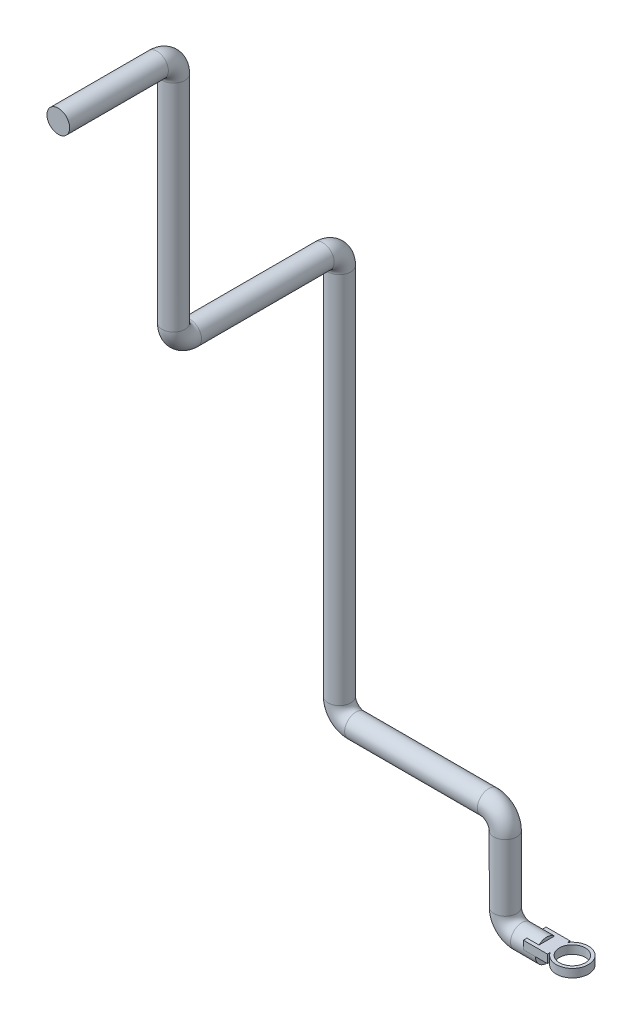
ISO-10303-21;
HEADER;
FILE_DESCRIPTION(('STEP AP214'),'2;1');
FILE_NAME('part.step','',(''),(''),'','','');
FILE_SCHEMA(('AUTOMOTIVE_DESIGN { 1 0 10303 214 1 1 1 1 }'));
ENDSEC;
DATA;
#1=APPLICATION_CONTEXT('core data for automotive mechanical design processes');
#2=APPLICATION_PROTOCOL_DEFINITION('international standard','automotive_design',2000,#1);
#3=PRODUCT_CONTEXT('',#1,'mechanical');
#4=PRODUCT('Part','Part','',(#3));
#5=PRODUCT_RELATED_PRODUCT_CATEGORY('part','',(#4));
#6=PRODUCT_DEFINITION_FORMATION('','',#4);
#7=PRODUCT_DEFINITION_CONTEXT('part definition',#1,'design');
#8=PRODUCT_DEFINITION('design','',#6,#7);
#9=PRODUCT_DEFINITION_SHAPE('','',#8);
#10=(LENGTH_UNIT() NAMED_UNIT(*) SI_UNIT(.MILLI.,.METRE.));
#11=(NAMED_UNIT(*) PLANE_ANGLE_UNIT() SI_UNIT($,.RADIAN.));
#12=(NAMED_UNIT(*) SI_UNIT($,.STERADIAN.) SOLID_ANGLE_UNIT());
#13=UNCERTAINTY_MEASURE_WITH_UNIT(LENGTH_MEASURE(1.E-05),#10,'distance_accuracy_value','');
#14=(GEOMETRIC_REPRESENTATION_CONTEXT(3) GLOBAL_UNCERTAINTY_ASSIGNED_CONTEXT((#13)) GLOBAL_UNIT_ASSIGNED_CONTEXT((#10,
#11,#12)) REPRESENTATION_CONTEXT('',''));
#15=CARTESIAN_POINT('',(0.,0.,0.));
#16=DIRECTION('',(0.,0.,1.));
#17=DIRECTION('',(1.,0.,0.));
#18=AXIS2_PLACEMENT_3D('',#15,#16,#17);
#19=CARTESIAN_POINT('',(14.5121336109629,10.,-13.7027745425676));
#20=DIRECTION('',(-1.,0.,0.));
#21=DIRECTION('',(0.,0.,1.));
#22=AXIS2_PLACEMENT_3D('',#19,#20,#21);
#23=PLANE('',#22);
#24=DIRECTION('',(0.,-1.,0.));
#25=VECTOR('',#24,1.);
#26=CARTESIAN_POINT('',(14.5121336109629,10.,-10.4322717356038));
#27=LINE('',#26,#25);
#28=CARTESIAN_POINT('',(14.5121336109629,0.,-10.4322717356038));
#29=VERTEX_POINT('',#28);
#30=CARTESIAN_POINT('',(14.5121336109629,10.,-10.4322717356038));
#31=VERTEX_POINT('',#30);
#32=EDGE_CURVE('E11',#29,#31,#27,.F.);
#33=ORIENTED_EDGE('',*,*,#32,.F.);
#34=DIRECTION('',(0.,0.,-1.));
#35=VECTOR('',#34,1.);
#36=CARTESIAN_POINT('',(14.5121336109629,0.,-13.7027745425676));
#37=LINE('',#36,#35);
#38=CARTESIAN_POINT('',(14.5121336109629,0.,-13.7027745425676));
#39=VERTEX_POINT('',#38);
#40=EDGE_CURVE('E120',#29,#39,#37,.T.);
#41=ORIENTED_EDGE('',*,*,#40,.T.);
#42=DIRECTION('',(0.,-1.,0.));
#43=VECTOR('',#42,1.);
#44=CARTESIAN_POINT('',(14.5121336109629,10.,-13.7027745425676));
#45=LINE('',#44,#43);
#46=CARTESIAN_POINT('',(14.5121336109629,10.,-13.7027745425676));
#47=VERTEX_POINT('',#46);
#48=EDGE_CURVE('E166',#47,#39,#45,.T.);
#49=ORIENTED_EDGE('',*,*,#48,.F.);
#50=DIRECTION('',(0.,0.,-1.));
#51=VECTOR('',#50,1.);
#52=CARTESIAN_POINT('',(14.5121336109629,10.,-13.7027745425676));
#53=LINE('',#52,#51);
#54=EDGE_CURVE('E49',#31,#47,#53,.T.);
#55=ORIENTED_EDGE('',*,*,#54,.F.);
#56=EDGE_LOOP('',(#33,#41,#49,#55));
#57=FACE_BOUND('',#56,.T.);
#58=ADVANCED_FACE('F34',(#57),#23,.F.);
#59=DIRECTION('',(0.,-1.,0.));
#60=VECTOR('',#59,1.);
#61=CARTESIAN_POINT('',(14.5121336109629,10.,10.4322717356038));
#62=LINE('',#61,#60);
#63=CARTESIAN_POINT('',(14.5121336109629,10.,10.4322717356038));
#64=VERTEX_POINT('',#63);
#65=CARTESIAN_POINT('',(14.5121336109629,0.,10.4322717356038));
#66=VERTEX_POINT('',#65);
#67=EDGE_CURVE('E42',#64,#66,#62,.T.);
#68=ORIENTED_EDGE('',*,*,#67,.F.);
#69=CARTESIAN_POINT('',(14.5121336109629,10.,13.7027745425676));
#70=VERTEX_POINT('',#69);
#71=EDGE_CURVE('E142',#70,#64,#53,.T.);
#72=ORIENTED_EDGE('',*,*,#71,.F.);
#73=DIRECTION('',(0.,-1.,0.));
#74=VECTOR('',#73,1.);
#75=CARTESIAN_POINT('',(14.5121336109629,10.,13.7027745425676));
#76=LINE('',#75,#74);
#77=CARTESIAN_POINT('',(14.5121336109629,0.,13.7027745425676));
#78=VERTEX_POINT('',#77);
#79=EDGE_CURVE('E115',#70,#78,#76,.T.);
#80=ORIENTED_EDGE('',*,*,#79,.T.);
#81=EDGE_CURVE('E112',#78,#66,#37,.T.);
#82=ORIENTED_EDGE('',*,*,#81,.T.);
#83=EDGE_LOOP('',(#68,#72,#80,#82));
#84=FACE_BOUND('',#83,.T.);
#85=ADVANCED_FACE('F113',(#84),#23,.F.);
#86=CARTESIAN_POINT('',(0.,0.,0.));
#87=DIRECTION('',(1.,0.,0.));
#88=DIRECTION('',(0.,0.,-1.));
#89=AXIS2_PLACEMENT_3D('',#86,#87,#88);
#90=PLANE('',#89);
#91=CARTESIAN_POINT('',(0.,0.,0.));
#92=DIRECTION('',(1.,0.,0.));
#93=DIRECTION('',(0.,0.,-1.));
#94=AXIS2_PLACEMENT_3D('',#91,#92,#93);
#95=CIRCLE('',#94,13.7);
#96=CARTESIAN_POINT('',(0.,0.,13.7));
#97=VERTEX_POINT('',#96);
#98=CARTESIAN_POINT('',(0.,0.,-13.7));
#99=VERTEX_POINT('',#98);
#100=EDGE_CURVE('E175',#97,#99,#95,.T.);
#101=ORIENTED_EDGE('',*,*,#100,.T.);
#102=DIRECTION('',(0.,0.,1.));
#103=VECTOR('',#102,1.);
#104=CARTESIAN_POINT('',(0.,0.,0.));
#105=LINE('',#104,#103);
#106=EDGE_CURVE('E169',#99,#97,#105,.T.);
#107=ORIENTED_EDGE('',*,*,#106,.T.);
#108=EDGE_LOOP('',(#101,#107));
#109=FACE_BOUND('',#108,.T.);
#110=ADVANCED_FACE('F247',(#109),#90,.T.);
#111=DIRECTION('',(0.,0.,1.));
#112=VECTOR('',#111,1.);
#113=CARTESIAN_POINT('',(0.,10.,0.));
#114=LINE('',#113,#112);
#115=CARTESIAN_POINT('',(0.,10.,-9.36429388688757));
#116=VERTEX_POINT('',#115);
#117=CARTESIAN_POINT('',(0.,10.,9.36429388688757));
#118=VERTEX_POINT('',#117);
#119=EDGE_CURVE('E172',#116,#118,#114,.T.);
#120=ORIENTED_EDGE('',*,*,#119,.F.);
#121=EDGE_CURVE('E178',#116,#118,#95,.T.);
#122=ORIENTED_EDGE('',*,*,#121,.T.);
#123=EDGE_LOOP('',(#120,#122));
#124=FACE_BOUND('',#123,.T.);
#125=ADVANCED_FACE('F36',(#124),#90,.T.);
#126=CARTESIAN_POINT('',(-250.,910.01,339.));
#127=DIRECTION('',(0.,0.,-1.));
#128=DIRECTION('',(0.,1.,0.));
#129=AXIS2_PLACEMENT_3D('',#126,#127,#128);
#130=PLANE('',#129);
#131=CARTESIAN_POINT('',(-250.,910.01,339.));
#132=DIRECTION('',(0.,0.,-1.));
#133=DIRECTION('',(0.,1.,0.));
#134=AXIS2_PLACEMENT_3D('',#131,#132,#133);
#135=CIRCLE('',#134,13.7);
#136=CARTESIAN_POINT('',(-250.,923.71,339.));
#137=VERTEX_POINT('',#136);
#138=EDGE_CURVE('E215',#137,#137,#135,.T.);
#139=ORIENTED_EDGE('',*,*,#138,.F.);
#140=EDGE_LOOP('',(#139));
#141=FACE_BOUND('',#140,.T.);
#142=ADVANCED_FACE('F258',(#141),#130,.F.);
#143=CARTESIAN_POINT('',(0.,0.,0.));
#144=DIRECTION('',(-1.,0.,0.));
#145=DIRECTION('',(0.,0.,1.));
#146=AXIS2_PLACEMENT_3D('',#143,#144,#145);
#147=CYLINDRICAL_SURFACE('',#146,13.7);
#148=CARTESIAN_POINT('',(-30.,0.,0.));
#149=DIRECTION('',(1.,0.,0.));
#150=DIRECTION('',(0.,0.,-1.));
#151=AXIS2_PLACEMENT_3D('',#148,#149,#150);
#152=CIRCLE('',#151,13.7);
#153=CARTESIAN_POINT('',(-30.,-13.7,0.));
#154=VERTEX_POINT('',#153);
#155=EDGE_CURVE('E179',#154,#154,#152,.T.);
#156=ORIENTED_EDGE('',*,*,#155,.T.);
#157=EDGE_LOOP('',(#156));
#158=FACE_BOUND('',#157,.T.);
#159=ORIENTED_EDGE('',*,*,#121,.F.);
#160=DIRECTION('',(-1.,0.,0.));
#161=VECTOR('',#160,1.);
#162=CARTESIAN_POINT('',(0.,10.,-9.36429388688757));
#163=LINE('',#162,#161);
#164=CARTESIAN_POINT('',(-14.5121336109629,10.,-9.36429388688757));
#165=VERTEX_POINT('',#164);
#166=EDGE_CURVE('E129',#116,#165,#163,.T.);
#167=ORIENTED_EDGE('',*,*,#166,.T.);
#168=CARTESIAN_POINT('',(-14.5121336109629,0.,0.));
#169=DIRECTION('',(1.,0.,0.));
#170=DIRECTION('',(0.,0.,-1.));
#171=AXIS2_PLACEMENT_3D('',#168,#169,#170);
#172=CIRCLE('',#171,13.7);
#173=CARTESIAN_POINT('',(-14.5121336109629,0.,-13.7));
#174=VERTEX_POINT('',#173);
#175=EDGE_CURVE('E224',#174,#165,#172,.T.);
#176=ORIENTED_EDGE('',*,*,#175,.F.);
#177=DIRECTION('',(-1.,0.,0.));
#178=VECTOR('',#177,1.);
#179=CARTESIAN_POINT('',(0.,0.,-13.7));
#180=LINE('',#179,#178);
#181=EDGE_CURVE('E226',#99,#174,#180,.T.);
#182=ORIENTED_EDGE('',*,*,#181,.F.);
#183=ORIENTED_EDGE('',*,*,#100,.F.);
#184=DIRECTION('',(-1.,0.,0.));
#185=VECTOR('',#184,1.);
#186=CARTESIAN_POINT('',(0.,0.,13.7));
#187=LINE('',#186,#185);
#188=CARTESIAN_POINT('',(-14.5121336109629,0.,13.7));
#189=VERTEX_POINT('',#188);
#190=EDGE_CURVE('E217',#189,#97,#187,.F.);
#191=ORIENTED_EDGE('',*,*,#190,.F.);
#192=CARTESIAN_POINT('',(-14.5121336109629,10.,9.36429388688757));
#193=VERTEX_POINT('',#192);
#194=EDGE_CURVE('E220',#193,#189,#172,.T.);
#195=ORIENTED_EDGE('',*,*,#194,.F.);
#196=DIRECTION('',(-1.,0.,0.));
#197=VECTOR('',#196,1.);
#198=CARTESIAN_POINT('',(0.,10.,9.36429388688757));
#199=LINE('',#198,#197);
#200=EDGE_CURVE('E223',#193,#118,#199,.F.);
#201=ORIENTED_EDGE('',*,*,#200,.T.);
#202=EDGE_LOOP('',(#159,#167,#176,#182,#183,#191,#195,#201));
#203=FACE_BOUND('',#202,.T.);
#204=ADVANCED_FACE('F245',(#158,#203),#147,.T.);
#205=CARTESIAN_POINT('',(-30.,20.,0.));
#206=DIRECTION('',(0.,0.,-1.));
#207=DIRECTION('',(-1.,0.,0.));
#208=AXIS2_PLACEMENT_3D('',#205,#206,#207);
#209=TOROIDAL_SURFACE('',#208,20.,13.7);
#210=CARTESIAN_POINT('',(-50.,20.,0.));
#211=DIRECTION('',(0.,-1.,0.));
#212=DIRECTION('',(0.,0.,-1.));
#213=AXIS2_PLACEMENT_3D('',#210,#211,#212);
#214=CIRCLE('',#213,13.7);
#215=CARTESIAN_POINT('',(-63.7,20.,0.));
#216=VERTEX_POINT('',#215);
#217=EDGE_CURVE('E182',#216,#216,#214,.T.);
#218=CARTESIAN_POINT('',(-30.,20.,0.));
#219=DIRECTION('',(0.,0.,-1.));
#220=DIRECTION('',(-1.,0.,0.));
#221=AXIS2_PLACEMENT_3D('',#218,#219,#220);
#222=CIRCLE('',#221,33.7);
#223=EDGE_CURVE('',#154,#216,#222,.T.);
#224=ORIENTED_EDGE('',*,*,#155,.F.);
#225=ORIENTED_EDGE('',*,*,#217,.T.);
#226=ORIENTED_EDGE('',*,*,#223,.T.);
#227=ORIENTED_EDGE('',*,*,#223,.F.);
#228=EDGE_LOOP('',(#224,#226,#225,#227));
#229=FACE_BOUND('',#228,.T.);
#230=ADVANCED_FACE('F276',(#229),#209,.T.);
#231=CARTESIAN_POINT('',(-50.,20.,0.));
#232=DIRECTION('',(0.,1.,0.));
#233=DIRECTION('',(0.,0.,1.));
#234=AXIS2_PLACEMENT_3D('',#231,#232,#233);
#235=CYLINDRICAL_SURFACE('',#234,13.7);
#236=CARTESIAN_POINT('',(-50.,100.,0.));
#237=DIRECTION('',(0.,-1.,0.));
#238=DIRECTION('',(0.,0.,-1.));
#239=AXIS2_PLACEMENT_3D('',#236,#237,#238);
#240=CIRCLE('',#239,13.7);
#241=CARTESIAN_POINT('',(-36.3,100.,0.));
#242=VERTEX_POINT('',#241);
#243=EDGE_CURVE('E185',#242,#242,#240,.T.);
#244=ORIENTED_EDGE('',*,*,#243,.T.);
#245=EDGE_LOOP('',(#244));
#246=FACE_BOUND('',#245,.T.);
#247=ORIENTED_EDGE('',*,*,#217,.F.);
#248=EDGE_LOOP('',(#247));
#249=FACE_BOUND('',#248,.T.);
#250=ADVANCED_FACE('F280',(#246,#249),#235,.T.);
#251=CARTESIAN_POINT('',(-70.,100.,0.));
#252=DIRECTION('',(0.,0.,1.));
#253=DIRECTION('',(1.,0.,0.));
#254=AXIS2_PLACEMENT_3D('',#251,#252,#253);
#255=TOROIDAL_SURFACE('',#254,20.,13.7);
#256=CARTESIAN_POINT('',(-70.,120.,0.));
#257=DIRECTION('',(1.,0.,0.));
#258=DIRECTION('',(0.,0.,-1.));
#259=AXIS2_PLACEMENT_3D('',#256,#257,#258);
#260=CIRCLE('',#259,13.7);
#261=CARTESIAN_POINT('',(-70.,133.7,0.));
#262=VERTEX_POINT('',#261);
#263=EDGE_CURVE('E188',#262,#262,#260,.T.);
#264=CARTESIAN_POINT('',(-70.,100.,0.));
#265=DIRECTION('',(0.,0.,1.));
#266=DIRECTION('',(1.,0.,0.));
#267=AXIS2_PLACEMENT_3D('',#264,#265,#266);
#268=CIRCLE('',#267,33.7);
#269=EDGE_CURVE('',#242,#262,#268,.T.);
#270=ORIENTED_EDGE('',*,*,#243,.F.);
#271=ORIENTED_EDGE('',*,*,#263,.T.);
#272=ORIENTED_EDGE('',*,*,#269,.T.);
#273=ORIENTED_EDGE('',*,*,#269,.F.);
#274=EDGE_LOOP('',(#270,#272,#271,#273));
#275=FACE_BOUND('',#274,.T.);
#276=ADVANCED_FACE('F284',(#275),#255,.T.);
#277=CARTESIAN_POINT('',(-70.,120.,0.));
#278=DIRECTION('',(-1.,0.,0.));
#279=DIRECTION('',(0.,-1.,0.));
#280=AXIS2_PLACEMENT_3D('',#277,#278,#279);
#281=CYLINDRICAL_SURFACE('',#280,13.7);
#282=CARTESIAN_POINT('',(-230.,120.,0.));
#283=DIRECTION('',(1.,0.,0.));
#284=DIRECTION('',(0.,0.,-1.));
#285=AXIS2_PLACEMENT_3D('',#282,#283,#284);
#286=CIRCLE('',#285,13.7);
#287=CARTESIAN_POINT('',(-230.,106.3,0.));
#288=VERTEX_POINT('',#287);
#289=EDGE_CURVE('E191',#288,#288,#286,.T.);
#290=ORIENTED_EDGE('',*,*,#289,.T.);
#291=EDGE_LOOP('',(#290));
#292=FACE_BOUND('',#291,.T.);
#293=ORIENTED_EDGE('',*,*,#263,.F.);
#294=EDGE_LOOP('',(#293));
#295=FACE_BOUND('',#294,.T.);
#296=ADVANCED_FACE('F288',(#292,#295),#281,.T.);
#297=CARTESIAN_POINT('',(-230.,140.,0.));
#298=DIRECTION('',(0.,0.,-1.));
#299=DIRECTION('',(-1.,0.,0.));
#300=AXIS2_PLACEMENT_3D('',#297,#298,#299);
#301=TOROIDAL_SURFACE('',#300,20.,13.7);
#302=CARTESIAN_POINT('',(-250.,140.,0.));
#303=DIRECTION('',(0.,-1.,0.));
#304=DIRECTION('',(0.,0.,-1.));
#305=AXIS2_PLACEMENT_3D('',#302,#303,#304);
#306=CIRCLE('',#305,13.7);
#307=CARTESIAN_POINT('',(-263.7,140.,0.));
#308=VERTEX_POINT('',#307);
#309=EDGE_CURVE('E194',#308,#308,#306,.T.);
#310=CARTESIAN_POINT('',(-230.,140.,0.));
#311=DIRECTION('',(0.,0.,-1.));
#312=DIRECTION('',(-1.,0.,0.));
#313=AXIS2_PLACEMENT_3D('',#310,#311,#312);
#314=CIRCLE('',#313,33.7);
#315=EDGE_CURVE('',#288,#308,#314,.T.);
#316=ORIENTED_EDGE('',*,*,#289,.F.);
#317=ORIENTED_EDGE('',*,*,#309,.T.);
#318=ORIENTED_EDGE('',*,*,#315,.T.);
#319=ORIENTED_EDGE('',*,*,#315,.F.);
#320=EDGE_LOOP('',(#316,#318,#317,#319));
#321=FACE_BOUND('',#320,.T.);
#322=ADVANCED_FACE('F292',(#321),#301,.T.);
#323=CARTESIAN_POINT('',(-250.,140.,0.));
#324=DIRECTION('',(0.,1.,0.));
#325=DIRECTION('',(0.,0.,1.));
#326=AXIS2_PLACEMENT_3D('',#323,#324,#325);
#327=CYLINDRICAL_SURFACE('',#326,13.7);
#328=CARTESIAN_POINT('',(-250.,590.01,0.));
#329=DIRECTION('',(0.,-1.,0.));
#330=DIRECTION('',(0.,0.,-1.));
#331=AXIS2_PLACEMENT_3D('',#328,#329,#330);
#332=CIRCLE('',#331,13.7);
#333=CARTESIAN_POINT('',(-250.,590.01,-13.7));
#334=VERTEX_POINT('',#333);
#335=EDGE_CURVE('E197',#334,#334,#332,.T.);
#336=ORIENTED_EDGE('',*,*,#335,.T.);
#337=EDGE_LOOP('',(#336));
#338=FACE_BOUND('',#337,.T.);
#339=ORIENTED_EDGE('',*,*,#309,.F.);
#340=EDGE_LOOP('',(#339));
#341=FACE_BOUND('',#340,.T.);
#342=ADVANCED_FACE('F296',(#338,#341),#327,.T.);
#343=CARTESIAN_POINT('',(-250.,590.01,20.));
#344=DIRECTION('',(1.,0.,0.));
#345=DIRECTION('',(0.,0.,-1.));
#346=AXIS2_PLACEMENT_3D('',#343,#344,#345);
#347=TOROIDAL_SURFACE('',#346,20.,13.7);
#348=CARTESIAN_POINT('',(-250.,610.01,20.));
#349=DIRECTION('',(0.,0.,-1.));
#350=DIRECTION('',(0.,1.,0.));
#351=AXIS2_PLACEMENT_3D('',#348,#349,#350);
#352=CIRCLE('',#351,13.7);
#353=CARTESIAN_POINT('',(-250.,623.71,20.));
#354=VERTEX_POINT('',#353);
#355=EDGE_CURVE('E200',#354,#354,#352,.T.);
#356=CARTESIAN_POINT('',(-250.,590.01,20.));
#357=DIRECTION('',(1.,0.,0.));
#358=DIRECTION('',(0.,0.,-1.));
#359=AXIS2_PLACEMENT_3D('',#356,#357,#358);
#360=CIRCLE('',#359,33.7);
#361=EDGE_CURVE('',#334,#354,#360,.T.);
#362=ORIENTED_EDGE('',*,*,#335,.F.);
#363=ORIENTED_EDGE('',*,*,#355,.T.);
#364=ORIENTED_EDGE('',*,*,#361,.T.);
#365=ORIENTED_EDGE('',*,*,#361,.F.);
#366=EDGE_LOOP('',(#362,#364,#363,#365));
#367=FACE_BOUND('',#366,.T.);
#368=ADVANCED_FACE('F300',(#367),#347,.T.);
#369=CARTESIAN_POINT('',(-250.,610.01,20.));
#370=DIRECTION('',(0.,0.,1.));
#371=DIRECTION('',(1.,0.,0.));
#372=AXIS2_PLACEMENT_3D('',#369,#370,#371);
#373=CYLINDRICAL_SURFACE('',#372,13.7);
#374=CARTESIAN_POINT('',(-250.,610.01,180.));
#375=DIRECTION('',(0.,0.,-1.));
#376=DIRECTION('',(0.,1.,0.));
#377=AXIS2_PLACEMENT_3D('',#374,#375,#376);
#378=CIRCLE('',#377,13.7);
#379=CARTESIAN_POINT('',(-250.,596.31,180.));
#380=VERTEX_POINT('',#379);
#381=EDGE_CURVE('E203',#380,#380,#378,.T.);
#382=ORIENTED_EDGE('',*,*,#381,.T.);
#383=EDGE_LOOP('',(#382));
#384=FACE_BOUND('',#383,.T.);
#385=ORIENTED_EDGE('',*,*,#355,.F.);
#386=EDGE_LOOP('',(#385));
#387=FACE_BOUND('',#386,.T.);
#388=ADVANCED_FACE('F304',(#384,#387),#373,.T.);
#389=CARTESIAN_POINT('',(-250.,630.01,180.));
#390=DIRECTION('',(-1.,0.,0.));
#391=DIRECTION('',(0.,0.,1.));
#392=AXIS2_PLACEMENT_3D('',#389,#390,#391);
#393=TOROIDAL_SURFACE('',#392,20.,13.7);
#394=CARTESIAN_POINT('',(-250.,630.01,200.));
#395=DIRECTION('',(0.,-1.,0.));
#396=DIRECTION('',(0.,0.,-1.));
#397=AXIS2_PLACEMENT_3D('',#394,#395,#396);
#398=CIRCLE('',#397,13.7);
#399=CARTESIAN_POINT('',(-250.,630.01,213.7));
#400=VERTEX_POINT('',#399);
#401=EDGE_CURVE('E206',#400,#400,#398,.T.);
#402=CARTESIAN_POINT('',(-250.,630.01,180.));
#403=DIRECTION('',(-1.,0.,0.));
#404=DIRECTION('',(0.,0.,1.));
#405=AXIS2_PLACEMENT_3D('',#402,#403,#404);
#406=CIRCLE('',#405,33.7);
#407=EDGE_CURVE('',#380,#400,#406,.T.);
#408=ORIENTED_EDGE('',*,*,#381,.F.);
#409=ORIENTED_EDGE('',*,*,#401,.T.);
#410=ORIENTED_EDGE('',*,*,#407,.T.);
#411=ORIENTED_EDGE('',*,*,#407,.F.);
#412=EDGE_LOOP('',(#408,#410,#409,#411));
#413=FACE_BOUND('',#412,.T.);
#414=ADVANCED_FACE('F308',(#413),#393,.T.);
#415=CARTESIAN_POINT('',(-250.,630.01,200.));
#416=DIRECTION('',(0.,1.,0.));
#417=DIRECTION('',(0.,0.,1.));
#418=AXIS2_PLACEMENT_3D('',#415,#416,#417);
#419=CYLINDRICAL_SURFACE('',#418,13.7);
#420=CARTESIAN_POINT('',(-250.,890.01,200.));
#421=DIRECTION('',(0.,-1.,0.));
#422=DIRECTION('',(0.,0.,-1.));
#423=AXIS2_PLACEMENT_3D('',#420,#421,#422);
#424=CIRCLE('',#423,13.7);
#425=CARTESIAN_POINT('',(-250.,890.01,186.3));
#426=VERTEX_POINT('',#425);
#427=EDGE_CURVE('E209',#426,#426,#424,.T.);
#428=ORIENTED_EDGE('',*,*,#427,.T.);
#429=EDGE_LOOP('',(#428));
#430=FACE_BOUND('',#429,.T.);
#431=ORIENTED_EDGE('',*,*,#401,.F.);
#432=EDGE_LOOP('',(#431));
#433=FACE_BOUND('',#432,.T.);
#434=ADVANCED_FACE('F312',(#430,#433),#419,.T.);
#435=CARTESIAN_POINT('',(-250.,890.01,220.));
#436=DIRECTION('',(1.,0.,0.));
#437=DIRECTION('',(0.,0.,-1.));
#438=AXIS2_PLACEMENT_3D('',#435,#436,#437);
#439=TOROIDAL_SURFACE('',#438,20.,13.7);
#440=CARTESIAN_POINT('',(-250.,910.01,220.));
#441=DIRECTION('',(0.,0.,-1.));
#442=DIRECTION('',(0.,1.,0.));
#443=AXIS2_PLACEMENT_3D('',#440,#441,#442);
#444=CIRCLE('',#443,13.7);
#445=CARTESIAN_POINT('',(-250.,923.71,220.));
#446=VERTEX_POINT('',#445);
#447=EDGE_CURVE('E212',#446,#446,#444,.T.);
#448=CARTESIAN_POINT('',(-250.,890.01,220.));
#449=DIRECTION('',(1.,0.,0.));
#450=DIRECTION('',(0.,0.,-1.));
#451=AXIS2_PLACEMENT_3D('',#448,#449,#450);
#452=CIRCLE('',#451,33.7);
#453=EDGE_CURVE('',#426,#446,#452,.T.);
#454=ORIENTED_EDGE('',*,*,#427,.F.);
#455=ORIENTED_EDGE('',*,*,#447,.T.);
#456=ORIENTED_EDGE('',*,*,#453,.T.);
#457=ORIENTED_EDGE('',*,*,#453,.F.);
#458=EDGE_LOOP('',(#454,#456,#455,#457));
#459=FACE_BOUND('',#458,.T.);
#460=ADVANCED_FACE('F316',(#459),#439,.T.);
#461=CARTESIAN_POINT('',(-250.,910.01,220.));
#462=DIRECTION('',(0.,0.,1.));
#463=DIRECTION('',(1.,0.,0.));
#464=AXIS2_PLACEMENT_3D('',#461,#462,#463);
#465=CYLINDRICAL_SURFACE('',#464,13.7);
#466=ORIENTED_EDGE('',*,*,#138,.T.);
#467=EDGE_LOOP('',(#466));
#468=FACE_BOUND('',#467,.T.);
#469=ORIENTED_EDGE('',*,*,#447,.F.);
#470=EDGE_LOOP('',(#469));
#471=FACE_BOUND('',#470,.T.);
#472=ADVANCED_FACE('F264',(#468,#471),#465,.T.);
#473=CARTESIAN_POINT('',(-14.5121336109629,10.,-13.7027745425676));
#474=DIRECTION('',(1.,0.,0.));
#475=DIRECTION('',(0.,0.,-1.));
#476=AXIS2_PLACEMENT_3D('',#473,#474,#475);
#477=PLANE('',#476);
#478=DIRECTION('',(0.,0.,1.));
#479=VECTOR('',#478,1.);
#480=CARTESIAN_POINT('',(-14.5121336109629,0.,-13.7027745425676));
#481=LINE('',#480,#479);
#482=CARTESIAN_POINT('',(-14.5121336109629,0.,-13.7027745425676));
#483=VERTEX_POINT('',#482);
#484=EDGE_CURVE('E154',#483,#174,#481,.T.);
#485=ORIENTED_EDGE('',*,*,#484,.T.);
#486=ORIENTED_EDGE('',*,*,#175,.T.);
#487=DIRECTION('',(0.,0.,1.));
#488=VECTOR('',#487,1.);
#489=CARTESIAN_POINT('',(-14.5121336109629,10.,-13.7027745425676));
#490=LINE('',#489,#488);
#491=CARTESIAN_POINT('',(-14.5121336109629,10.,-13.7027745425676));
#492=VERTEX_POINT('',#491);
#493=EDGE_CURVE('E147',#492,#165,#490,.T.);
#494=ORIENTED_EDGE('',*,*,#493,.F.);
#495=DIRECTION('',(0.,-1.,0.));
#496=VECTOR('',#495,1.);
#497=CARTESIAN_POINT('',(-14.5121336109629,10.,-13.7027745425676));
#498=LINE('',#497,#496);
#499=EDGE_CURVE('E163',#492,#483,#498,.T.);
#500=ORIENTED_EDGE('',*,*,#499,.T.);
#501=EDGE_LOOP('',(#485,#486,#494,#500));
#502=FACE_BOUND('',#501,.T.);
#503=ADVANCED_FACE('F235',(#502),#477,.F.);
#504=CARTESIAN_POINT('',(0.,10.,0.));
#505=DIRECTION('',(0.,1.,0.));
#506=DIRECTION('',(0.,0.,1.));
#507=AXIS2_PLACEMENT_3D('',#504,#505,#506);
#508=PLANE('',#507);
#509=ORIENTED_EDGE('',*,*,#71,.T.);
#510=CARTESIAN_POINT('',(30.8520765194422,10.,0.));
#511=DIRECTION('',(0.,1.,0.));
#512=DIRECTION('',(0.,0.,1.));
#513=AXIS2_PLACEMENT_3D('',#510,#511,#512);
#514=CIRCLE('',#513,19.3862329455168);
#515=EDGE_CURVE('E128',#64,#31,#514,.T.);
#516=ORIENTED_EDGE('',*,*,#515,.T.);
#517=ORIENTED_EDGE('',*,*,#54,.T.);
#518=DIRECTION('',(-1.,0.,0.));
#519=VECTOR('',#518,1.);
#520=CARTESIAN_POINT('',(-14.5121336109629,10.,-13.7027745425676));
#521=LINE('',#520,#519);
#522=EDGE_CURVE('E144',#47,#492,#521,.T.);
#523=ORIENTED_EDGE('',*,*,#522,.T.);
#524=ORIENTED_EDGE('',*,*,#493,.T.);
#525=ORIENTED_EDGE('',*,*,#166,.F.);
#526=ORIENTED_EDGE('',*,*,#119,.T.);
#527=ORIENTED_EDGE('',*,*,#200,.F.);
#528=CARTESIAN_POINT('',(-14.5121336109629,10.,13.7027745425676));
#529=VERTEX_POINT('',#528);
#530=EDGE_CURVE('E146',#193,#529,#490,.T.);
#531=ORIENTED_EDGE('',*,*,#530,.T.);
#532=DIRECTION('',(1.,0.,0.));
#533=VECTOR('',#532,1.);
#534=CARTESIAN_POINT('',(-14.5121336109629,10.,13.7027745425676));
#535=LINE('',#534,#533);
#536=EDGE_CURVE('E150',#529,#70,#535,.T.);
#537=ORIENTED_EDGE('',*,*,#536,.T.);
#538=EDGE_LOOP('',(#509,#516,#517,#523,#524,#525,#526,#527,#531,#537));
#539=FACE_BOUND('',#538,.T.);
#540=CARTESIAN_POINT('',(30.8520765194422,10.,0.));
#541=DIRECTION('',(0.,1.,0.));
#542=DIRECTION('',(0.,0.,1.));
#543=AXIS2_PLACEMENT_3D('',#540,#541,#542);
#544=CIRCLE('',#543,15.5692832485257);
#545=CARTESIAN_POINT('',(30.8520765194422,10.,15.5692832485257));
#546=VERTEX_POINT('',#545);
#547=EDGE_CURVE('E134',#546,#546,#544,.T.);
#548=ORIENTED_EDGE('',*,*,#547,.F.);
#549=EDGE_LOOP('',(#548));
#550=FACE_BOUND('',#549,.T.);
#551=ADVANCED_FACE('F238',(#539,#550),#508,.T.);
#552=CARTESIAN_POINT('',(0.,0.,0.));
#553=DIRECTION('',(0.,1.,0.));
#554=DIRECTION('',(0.,0.,1.));
#555=AXIS2_PLACEMENT_3D('',#552,#553,#554);
#556=PLANE('',#555);
#557=ORIENTED_EDGE('',*,*,#40,.F.);
#558=CARTESIAN_POINT('',(30.8520765194422,0.,0.));
#559=DIRECTION('',(0.,1.,0.));
#560=DIRECTION('',(0.,0.,1.));
#561=AXIS2_PLACEMENT_3D('',#558,#559,#560);
#562=CIRCLE('',#561,19.3862329455168);
#563=EDGE_CURVE('E126',#66,#29,#562,.T.);
#564=ORIENTED_EDGE('',*,*,#563,.F.);
#565=ORIENTED_EDGE('',*,*,#81,.F.);
#566=DIRECTION('',(1.,0.,0.));
#567=VECTOR('',#566,1.);
#568=CARTESIAN_POINT('',(-14.5121336109629,0.,13.7027745425676));
#569=LINE('',#568,#567);
#570=CARTESIAN_POINT('',(-14.5121336109629,0.,13.7027745425676));
#571=VERTEX_POINT('',#570);
#572=EDGE_CURVE('E157',#571,#78,#569,.T.);
#573=ORIENTED_EDGE('',*,*,#572,.F.);
#574=EDGE_CURVE('E153',#189,#571,#481,.T.);
#575=ORIENTED_EDGE('',*,*,#574,.F.);
#576=ORIENTED_EDGE('',*,*,#190,.T.);
#577=ORIENTED_EDGE('',*,*,#106,.F.);
#578=ORIENTED_EDGE('',*,*,#181,.T.);
#579=ORIENTED_EDGE('',*,*,#484,.F.);
#580=DIRECTION('',(-1.,0.,0.));
#581=VECTOR('',#580,1.);
#582=CARTESIAN_POINT('',(-14.5121336109629,0.,-13.7027745425676));
#583=LINE('',#582,#581);
#584=EDGE_CURVE('E119',#39,#483,#583,.T.);
#585=ORIENTED_EDGE('',*,*,#584,.F.);
#586=EDGE_LOOP('',(#557,#564,#565,#573,#575,#576,#577,#578,#579,#585));
#587=FACE_BOUND('',#586,.T.);
#588=CARTESIAN_POINT('',(30.8520765194422,0.,0.));
#589=DIRECTION('',(0.,1.,0.));
#590=DIRECTION('',(0.,0.,1.));
#591=AXIS2_PLACEMENT_3D('',#588,#589,#590);
#592=CIRCLE('',#591,15.5692832485257);
#593=CARTESIAN_POINT('',(30.8520765194422,0.,15.5692832485257));
#594=VERTEX_POINT('',#593);
#595=EDGE_CURVE('E138',#594,#594,#592,.T.);
#596=ORIENTED_EDGE('',*,*,#595,.T.);
#597=EDGE_LOOP('',(#596));
#598=FACE_BOUND('',#597,.T.);
#599=ADVANCED_FACE('F131',(#587,#598),#556,.F.);
#600=CARTESIAN_POINT('',(-14.5121336109629,10.,-13.7027745425676));
#601=DIRECTION('',(0.,0.,1.));
#602=DIRECTION('',(1.,0.,0.));
#603=AXIS2_PLACEMENT_3D('',#600,#601,#602);
#604=PLANE('',#603);
#605=ORIENTED_EDGE('',*,*,#584,.T.);
#606=ORIENTED_EDGE('',*,*,#499,.F.);
#607=ORIENTED_EDGE('',*,*,#522,.F.);
#608=ORIENTED_EDGE('',*,*,#48,.T.);
#609=EDGE_LOOP('',(#605,#606,#607,#608));
#610=FACE_BOUND('',#609,.T.);
#611=ADVANCED_FACE('F243',(#610),#604,.F.);
#612=ORIENTED_EDGE('',*,*,#530,.F.);
#613=ORIENTED_EDGE('',*,*,#194,.T.);
#614=ORIENTED_EDGE('',*,*,#574,.T.);
#615=DIRECTION('',(0.,-1.,0.));
#616=VECTOR('',#615,1.);
#617=CARTESIAN_POINT('',(-14.5121336109629,10.,13.7027745425676));
#618=LINE('',#617,#616);
#619=EDGE_CURVE('E160',#529,#571,#618,.T.);
#620=ORIENTED_EDGE('',*,*,#619,.F.);
#621=EDGE_LOOP('',(#612,#613,#614,#620));
#622=FACE_BOUND('',#621,.T.);
#623=ADVANCED_FACE('F252',(#622),#477,.F.);
#624=CARTESIAN_POINT('',(-14.5121336109629,10.,13.7027745425676));
#625=DIRECTION('',(0.,0.,-1.));
#626=DIRECTION('',(-1.,0.,0.));
#627=AXIS2_PLACEMENT_3D('',#624,#625,#626);
#628=PLANE('',#627);
#629=ORIENTED_EDGE('',*,*,#572,.T.);
#630=ORIENTED_EDGE('',*,*,#79,.F.);
#631=ORIENTED_EDGE('',*,*,#536,.F.);
#632=ORIENTED_EDGE('',*,*,#619,.T.);
#633=EDGE_LOOP('',(#629,#630,#631,#632));
#634=FACE_BOUND('',#633,.T.);
#635=ADVANCED_FACE('F382',(#634),#628,.F.);
#636=CARTESIAN_POINT('',(30.8520765194422,10.,0.));
#637=DIRECTION('',(0.,-1.,0.));
#638=DIRECTION('',(0.,0.,-1.));
#639=AXIS2_PLACEMENT_3D('',#636,#637,#638);
#640=CYLINDRICAL_SURFACE('',#639,19.3862329455168);
#641=ORIENTED_EDGE('',*,*,#563,.T.);
#642=ORIENTED_EDGE('',*,*,#32,.T.);
#643=ORIENTED_EDGE('',*,*,#515,.F.);
#644=ORIENTED_EDGE('',*,*,#67,.T.);
#645=EDGE_LOOP('',(#641,#642,#643,#644));
#646=FACE_BOUND('',#645,.T.);
#647=ADVANCED_FACE('F125',(#646),#640,.T.);
#648=CARTESIAN_POINT('',(30.8520765194422,10.,0.));
#649=DIRECTION('',(0.,-1.,0.));
#650=DIRECTION('',(0.,0.,-1.));
#651=AXIS2_PLACEMENT_3D('',#648,#649,#650);
#652=CYLINDRICAL_SURFACE('',#651,15.5692832485257);
#653=ORIENTED_EDGE('',*,*,#547,.T.);
#654=EDGE_LOOP('',(#653));
#655=FACE_BOUND('',#654,.T.);
#656=ORIENTED_EDGE('',*,*,#595,.F.);
#657=EDGE_LOOP('',(#656));
#658=FACE_BOUND('',#657,.T.);
#659=ADVANCED_FACE('F394',(#655,#658),#652,.F.);
#660=CLOSED_SHELL('',(#58,#85,#110,#125,#142,#204,#230,#250,#276,#296,#322,#342,#368,#388,#414,
#434,#460,#472,#503,#551,#599,#611,#623,#635,#647,#659));
#661=MANIFOLD_SOLID_BREP('B2',#660);
#662=ADVANCED_BREP_SHAPE_REPRESENTATION('',(#18,#661),#14);
#663=SHAPE_DEFINITION_REPRESENTATION(#9,#662);
ENDSEC;
END-ISO-10303-21;
